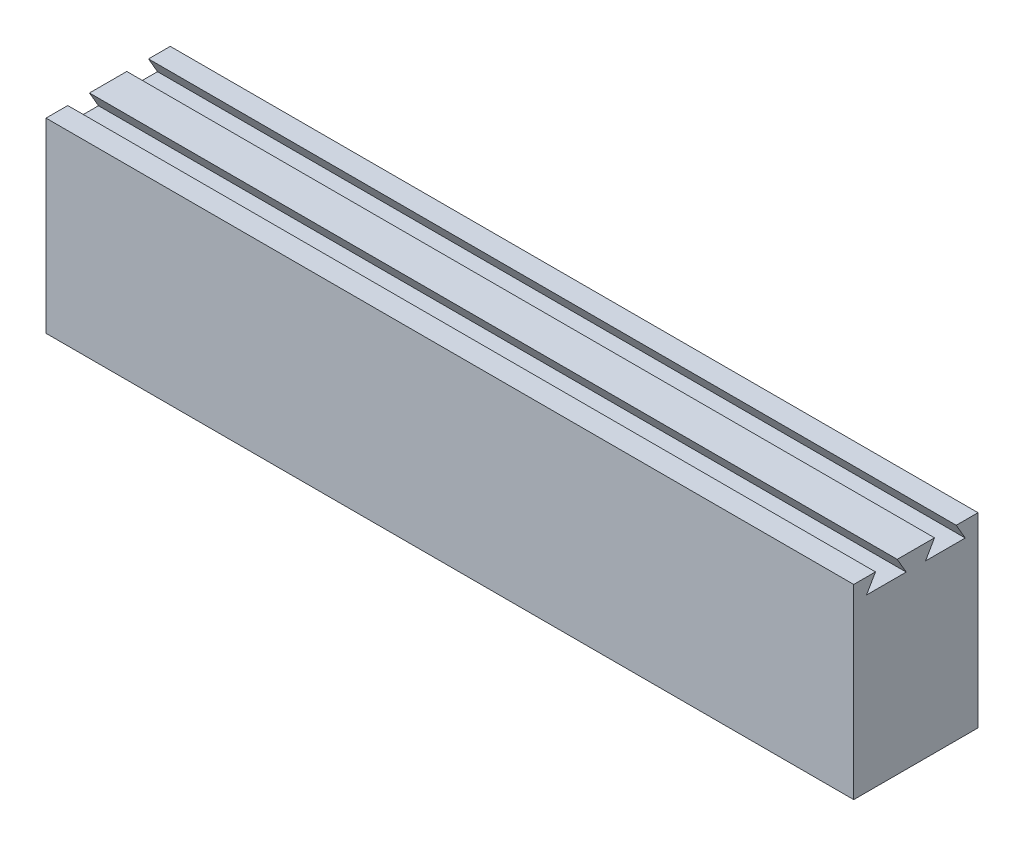
ISO-10303-21;
HEADER;
FILE_DESCRIPTION(('STEP AP214'),'2;1');
FILE_NAME('part.step','',(''),(''),'','','');
FILE_SCHEMA(('AUTOMOTIVE_DESIGN { 1 0 10303 214 1 1 1 1 }'));
ENDSEC;
DATA;
#1=APPLICATION_CONTEXT('core data for automotive mechanical design processes');
#2=APPLICATION_PROTOCOL_DEFINITION('international standard','automotive_design',2000,#1);
#3=PRODUCT_CONTEXT('',#1,'mechanical');
#4=PRODUCT('Part','Part','',(#3));
#5=PRODUCT_RELATED_PRODUCT_CATEGORY('part','',(#4));
#6=PRODUCT_DEFINITION_FORMATION('','',#4);
#7=PRODUCT_DEFINITION_CONTEXT('part definition',#1,'design');
#8=PRODUCT_DEFINITION('design','',#6,#7);
#9=PRODUCT_DEFINITION_SHAPE('','',#8);
#10=(LENGTH_UNIT() NAMED_UNIT(*) SI_UNIT(.MILLI.,.METRE.));
#11=(NAMED_UNIT(*) PLANE_ANGLE_UNIT() SI_UNIT($,.RADIAN.));
#12=(NAMED_UNIT(*) SI_UNIT($,.STERADIAN.) SOLID_ANGLE_UNIT());
#13=UNCERTAINTY_MEASURE_WITH_UNIT(LENGTH_MEASURE(1.E-05),#10,'distance_accuracy_value','');
#14=(GEOMETRIC_REPRESENTATION_CONTEXT(3) GLOBAL_UNCERTAINTY_ASSIGNED_CONTEXT((#13)) GLOBAL_UNIT_ASSIGNED_CONTEXT((#10,
#11,#12)) REPRESENTATION_CONTEXT('',''));
#15=CARTESIAN_POINT('',(0.,0.,0.));
#16=DIRECTION('',(0.,0.,1.));
#17=DIRECTION('',(1.,0.,0.));
#18=AXIS2_PLACEMENT_3D('',#15,#16,#17);
#19=CARTESIAN_POINT('',(65.,2.45096189432339,4.24519052838333));
#20=DIRECTION('',(0.,-0.500000000000004,-0.866025403784436));
#21=DIRECTION('',(0.,0.866025403784437,-0.500000000000004));
#22=AXIS2_PLACEMENT_3D('',#19,#20,#21);
#23=PLANE('',#22);
#24=DIRECTION('',(0.,-0.866025403784437,0.500000000000004));
#25=VECTOR('',#24,1.);
#26=CARTESIAN_POINT('',(-65.,2.45096189432339,4.24519052838333));
#27=LINE('',#26,#25);
#28=CARTESIAN_POINT('',(-65.,15.,-3.));
#29=VERTEX_POINT('',#28);
#30=CARTESIAN_POINT('',(-65.,12.497186583063,-1.555));
#31=VERTEX_POINT('',#30);
#32=EDGE_CURVE('E165',#29,#31,#27,.T.);
#33=ORIENTED_EDGE('',*,*,#32,.F.);
#34=DIRECTION('',(-1.,0.,0.));
#35=VECTOR('',#34,1.);
#36=CARTESIAN_POINT('',(65.,15.,-3.));
#37=LINE('',#36,#35);
#38=CARTESIAN_POINT('',(65.,15.,-3.));
#39=VERTEX_POINT('',#38);
#40=EDGE_CURVE('E11',#39,#29,#37,.T.);
#41=ORIENTED_EDGE('',*,*,#40,.F.);
#42=DIRECTION('',(0.,-0.866025403784437,0.500000000000004));
#43=VECTOR('',#42,1.);
#44=CARTESIAN_POINT('',(65.,2.45096189432339,4.24519052838333));
#45=LINE('',#44,#43);
#46=CARTESIAN_POINT('',(65.,12.497186583063,-1.555));
#47=VERTEX_POINT('',#46);
#48=EDGE_CURVE('E201',#39,#47,#45,.T.);
#49=ORIENTED_EDGE('',*,*,#48,.T.);
#50=DIRECTION('',(-1.,0.,0.));
#51=VECTOR('',#50,1.);
#52=CARTESIAN_POINT('',(65.,12.497186583063,-1.555));
#53=LINE('',#52,#51);
#54=EDGE_CURVE('E58',#47,#31,#53,.T.);
#55=ORIENTED_EDGE('',*,*,#54,.T.);
#56=EDGE_LOOP('',(#33,#41,#49,#55));
#57=FACE_BOUND('',#56,.T.);
#58=ADVANCED_FACE('F41',(#57),#23,.T.);
#59=CARTESIAN_POINT('',(65.,15.,0.));
#60=DIRECTION('',(0.,1.,0.));
#61=DIRECTION('',(0.,0.,1.));
#62=AXIS2_PLACEMENT_3D('',#59,#60,#61);
#63=PLANE('',#62);
#64=DIRECTION('',(0.,0.,-1.));
#65=VECTOR('',#64,1.);
#66=CARTESIAN_POINT('',(-65.,15.,0.));
#67=LINE('',#66,#65);
#68=CARTESIAN_POINT('',(-65.,15.,3.));
#69=VERTEX_POINT('',#68);
#70=EDGE_CURVE('E168',#69,#29,#67,.T.);
#71=ORIENTED_EDGE('',*,*,#70,.F.);
#72=DIRECTION('',(-1.,0.,0.));
#73=VECTOR('',#72,1.);
#74=CARTESIAN_POINT('',(65.,15.,3.));
#75=LINE('',#74,#73);
#76=CARTESIAN_POINT('',(65.,15.,3.));
#77=VERTEX_POINT('',#76);
#78=EDGE_CURVE('E50',#77,#69,#75,.T.);
#79=ORIENTED_EDGE('',*,*,#78,.F.);
#80=DIRECTION('',(0.,0.,-1.));
#81=VECTOR('',#80,1.);
#82=CARTESIAN_POINT('',(65.,15.,0.));
#83=LINE('',#82,#81);
#84=EDGE_CURVE('E155',#77,#39,#83,.T.);
#85=ORIENTED_EDGE('',*,*,#84,.T.);
#86=ORIENTED_EDGE('',*,*,#40,.T.);
#87=EDGE_LOOP('',(#71,#79,#85,#86));
#88=FACE_BOUND('',#87,.T.);
#89=ADVANCED_FACE('F243',(#88),#63,.T.);
#90=CARTESIAN_POINT('',(65.,2.45096189432339,-4.24519052838333));
#91=DIRECTION('',(0.,0.500000000000004,-0.866025403784436));
#92=DIRECTION('',(0.,0.866025403784437,0.500000000000004));
#93=AXIS2_PLACEMENT_3D('',#90,#91,#92);
#94=PLANE('',#93);
#95=DIRECTION('',(0.,-0.866025403784437,-0.500000000000004));
#96=VECTOR('',#95,1.);
#97=CARTESIAN_POINT('',(-65.,2.45096189432339,-4.24519052838333));
#98=LINE('',#97,#96);
#99=CARTESIAN_POINT('',(-65.,12.497186583063,1.555));
#100=VERTEX_POINT('',#99);
#101=EDGE_CURVE('E172',#69,#100,#98,.T.);
#102=ORIENTED_EDGE('',*,*,#101,.T.);
#103=DIRECTION('',(-1.,0.,0.));
#104=VECTOR('',#103,1.);
#105=CARTESIAN_POINT('',(65.,12.497186583063,1.555));
#106=LINE('',#105,#104);
#107=CARTESIAN_POINT('',(65.,12.497186583063,1.555));
#108=VERTEX_POINT('',#107);
#109=EDGE_CURVE('E225',#108,#100,#106,.T.);
#110=ORIENTED_EDGE('',*,*,#109,.F.);
#111=DIRECTION('',(0.,-0.866025403784437,-0.500000000000004));
#112=VECTOR('',#111,1.);
#113=CARTESIAN_POINT('',(65.,2.45096189432339,-4.24519052838333));
#114=LINE('',#113,#112);
#115=EDGE_CURVE('E234',#77,#108,#114,.T.);
#116=ORIENTED_EDGE('',*,*,#115,.F.);
#117=ORIENTED_EDGE('',*,*,#78,.T.);
#118=EDGE_LOOP('',(#102,#110,#116,#117));
#119=FACE_BOUND('',#118,.T.);
#120=ADVANCED_FACE('F232',(#119),#94,.F.);
#121=CARTESIAN_POINT('',(65.,12.497186583063,0.));
#122=DIRECTION('',(0.,-1.,0.));
#123=DIRECTION('',(0.,0.,-1.));
#124=AXIS2_PLACEMENT_3D('',#121,#122,#123);
#125=PLANE('',#124);
#126=DIRECTION('',(0.,0.,1.));
#127=VECTOR('',#126,1.);
#128=CARTESIAN_POINT('',(-65.,12.497186583063,0.));
#129=LINE('',#128,#127);
#130=CARTESIAN_POINT('',(-65.,12.497186583063,7.945));
#131=VERTEX_POINT('',#130);
#132=EDGE_CURVE('E176',#100,#131,#129,.T.);
#133=ORIENTED_EDGE('',*,*,#132,.T.);
#134=DIRECTION('',(-1.,0.,0.));
#135=VECTOR('',#134,1.);
#136=CARTESIAN_POINT('',(65.,12.497186583063,7.945));
#137=LINE('',#136,#135);
#138=CARTESIAN_POINT('',(65.,12.497186583063,7.945));
#139=VERTEX_POINT('',#138);
#140=EDGE_CURVE('E221',#139,#131,#137,.T.);
#141=ORIENTED_EDGE('',*,*,#140,.F.);
#142=DIRECTION('',(0.,0.,1.));
#143=VECTOR('',#142,1.);
#144=CARTESIAN_POINT('',(65.,12.497186583063,0.));
#145=LINE('',#144,#143);
#146=EDGE_CURVE('E316',#108,#139,#145,.T.);
#147=ORIENTED_EDGE('',*,*,#146,.F.);
#148=ORIENTED_EDGE('',*,*,#109,.T.);
#149=EDGE_LOOP('',(#133,#141,#147,#148));
#150=FACE_BOUND('',#149,.T.);
#151=ADVANCED_FACE('F263',(#150),#125,.F.);
#152=CARTESIAN_POINT('',(65.,6.56458256229951,11.3701905283833));
#153=DIRECTION('',(0.,0.500000000000005,0.866025403784436));
#154=DIRECTION('',(0.,-0.866025403784436,0.500000000000005));
#155=AXIS2_PLACEMENT_3D('',#152,#153,#154);
#156=PLANE('',#155);
#157=DIRECTION('',(0.,0.866025403784436,-0.500000000000005));
#158=VECTOR('',#157,1.);
#159=CARTESIAN_POINT('',(-65.,6.56458256229951,11.3701905283833));
#160=LINE('',#159,#158);
#161=CARTESIAN_POINT('',(-65.,15.,6.49999999999999));
#162=VERTEX_POINT('',#161);
#163=EDGE_CURVE('E179',#131,#162,#160,.T.);
#164=ORIENTED_EDGE('',*,*,#163,.T.);
#165=DIRECTION('',(-1.,0.,0.));
#166=VECTOR('',#165,1.);
#167=CARTESIAN_POINT('',(65.,15.,6.49999999999999));
#168=LINE('',#167,#166);
#169=CARTESIAN_POINT('',(65.,15.,6.49999999999999));
#170=VERTEX_POINT('',#169);
#171=EDGE_CURVE('E218',#170,#162,#168,.T.);
#172=ORIENTED_EDGE('',*,*,#171,.F.);
#173=DIRECTION('',(0.,0.866025403784436,-0.500000000000005));
#174=VECTOR('',#173,1.);
#175=CARTESIAN_POINT('',(65.,6.56458256229951,11.3701905283833));
#176=LINE('',#175,#174);
#177=EDGE_CURVE('E297',#139,#170,#176,.T.);
#178=ORIENTED_EDGE('',*,*,#177,.F.);
#179=ORIENTED_EDGE('',*,*,#140,.T.);
#180=EDGE_LOOP('',(#164,#172,#178,#179));
#181=FACE_BOUND('',#180,.T.);
#182=ADVANCED_FACE('F267',(#181),#156,.F.);
#183=CARTESIAN_POINT('',(-65.,15.,10.));
#184=VERTEX_POINT('',#183);
#185=EDGE_CURVE('E173',#184,#162,#67,.T.);
#186=ORIENTED_EDGE('',*,*,#185,.F.);
#187=DIRECTION('',(-1.,0.,0.));
#188=VECTOR('',#187,1.);
#189=CARTESIAN_POINT('',(65.,15.,10.));
#190=LINE('',#189,#188);
#191=CARTESIAN_POINT('',(65.,15.,10.));
#192=VERTEX_POINT('',#191);
#193=EDGE_CURVE('E215',#192,#184,#190,.T.);
#194=ORIENTED_EDGE('',*,*,#193,.F.);
#195=EDGE_CURVE('E154',#192,#170,#83,.T.);
#196=ORIENTED_EDGE('',*,*,#195,.T.);
#197=ORIENTED_EDGE('',*,*,#171,.T.);
#198=EDGE_LOOP('',(#186,#194,#196,#197));
#199=FACE_BOUND('',#198,.T.);
#200=ADVANCED_FACE('F259',(#199),#63,.T.);
#201=CARTESIAN_POINT('',(65.,0.,10.));
#202=DIRECTION('',(0.,0.,1.));
#203=DIRECTION('',(0.,-1.,0.));
#204=AXIS2_PLACEMENT_3D('',#201,#202,#203);
#205=PLANE('',#204);
#206=DIRECTION('',(0.,1.,0.));
#207=VECTOR('',#206,1.);
#208=CARTESIAN_POINT('',(-65.,0.,10.));
#209=LINE('',#208,#207);
#210=CARTESIAN_POINT('',(-65.,-15.,10.));
#211=VERTEX_POINT('',#210);
#212=EDGE_CURVE('E183',#211,#184,#209,.T.);
#213=ORIENTED_EDGE('',*,*,#212,.F.);
#214=DIRECTION('',(-1.,0.,0.));
#215=VECTOR('',#214,1.);
#216=CARTESIAN_POINT('',(65.,-15.,10.));
#217=LINE('',#216,#215);
#218=CARTESIAN_POINT('',(65.,-15.,10.));
#219=VERTEX_POINT('',#218);
#220=EDGE_CURVE('E212',#219,#211,#217,.T.);
#221=ORIENTED_EDGE('',*,*,#220,.F.);
#222=DIRECTION('',(0.,1.,0.));
#223=VECTOR('',#222,1.);
#224=CARTESIAN_POINT('',(65.,0.,10.));
#225=LINE('',#224,#223);
#226=EDGE_CURVE('E309',#219,#192,#225,.T.);
#227=ORIENTED_EDGE('',*,*,#226,.T.);
#228=ORIENTED_EDGE('',*,*,#193,.T.);
#229=EDGE_LOOP('',(#213,#221,#227,#228));
#230=FACE_BOUND('',#229,.T.);
#231=ADVANCED_FACE('F266',(#230),#205,.T.);
#232=CARTESIAN_POINT('',(65.,-15.,0.));
#233=DIRECTION('',(0.,1.,0.));
#234=DIRECTION('',(0.,0.,1.));
#235=AXIS2_PLACEMENT_3D('',#232,#233,#234);
#236=PLANE('',#235);
#237=DIRECTION('',(0.,0.,-1.));
#238=VECTOR('',#237,1.);
#239=CARTESIAN_POINT('',(-65.,-15.,0.));
#240=LINE('',#239,#238);
#241=CARTESIAN_POINT('',(-65.,-15.,-10.));
#242=VERTEX_POINT('',#241);
#243=EDGE_CURVE('E187',#211,#242,#240,.T.);
#244=ORIENTED_EDGE('',*,*,#243,.T.);
#245=DIRECTION('',(-1.,0.,0.));
#246=VECTOR('',#245,1.);
#247=CARTESIAN_POINT('',(65.,-15.,-10.));
#248=LINE('',#247,#246);
#249=CARTESIAN_POINT('',(65.,-15.,-10.));
#250=VERTEX_POINT('',#249);
#251=EDGE_CURVE('E208',#250,#242,#248,.T.);
#252=ORIENTED_EDGE('',*,*,#251,.F.);
#253=DIRECTION('',(0.,0.,-1.));
#254=VECTOR('',#253,1.);
#255=CARTESIAN_POINT('',(65.,-15.,0.));
#256=LINE('',#255,#254);
#257=EDGE_CURVE('E306',#219,#250,#256,.T.);
#258=ORIENTED_EDGE('',*,*,#257,.F.);
#259=ORIENTED_EDGE('',*,*,#220,.T.);
#260=EDGE_LOOP('',(#244,#252,#258,#259));
#261=FACE_BOUND('',#260,.T.);
#262=ADVANCED_FACE('F274',(#261),#236,.F.);
#263=CARTESIAN_POINT('',(65.,0.,-10.));
#264=DIRECTION('',(0.,0.,1.));
#265=DIRECTION('',(0.,-1.,0.));
#266=AXIS2_PLACEMENT_3D('',#263,#264,#265);
#267=PLANE('',#266);
#268=DIRECTION('',(0.,1.,0.));
#269=VECTOR('',#268,1.);
#270=CARTESIAN_POINT('',(-65.,0.,-10.));
#271=LINE('',#270,#269);
#272=CARTESIAN_POINT('',(-65.,15.,-10.));
#273=VERTEX_POINT('',#272);
#274=EDGE_CURVE('E190',#242,#273,#271,.T.);
#275=ORIENTED_EDGE('',*,*,#274,.T.);
#276=DIRECTION('',(-1.,0.,0.));
#277=VECTOR('',#276,1.);
#278=CARTESIAN_POINT('',(65.,15.,-10.));
#279=LINE('',#278,#277);
#280=CARTESIAN_POINT('',(65.,15.,-10.));
#281=VERTEX_POINT('',#280);
#282=EDGE_CURVE('E142',#281,#273,#279,.T.);
#283=ORIENTED_EDGE('',*,*,#282,.F.);
#284=DIRECTION('',(0.,1.,0.));
#285=VECTOR('',#284,1.);
#286=CARTESIAN_POINT('',(65.,0.,-10.));
#287=LINE('',#286,#285);
#288=EDGE_CURVE('E150',#250,#281,#287,.T.);
#289=ORIENTED_EDGE('',*,*,#288,.F.);
#290=ORIENTED_EDGE('',*,*,#251,.T.);
#291=EDGE_LOOP('',(#275,#283,#289,#290));
#292=FACE_BOUND('',#291,.T.);
#293=ADVANCED_FACE('F270',(#292),#267,.F.);
#294=CARTESIAN_POINT('',(-65.,15.,-6.49999999999999));
#295=VERTEX_POINT('',#294);
#296=EDGE_CURVE('E137',#295,#273,#67,.T.);
#297=ORIENTED_EDGE('',*,*,#296,.F.);
#298=DIRECTION('',(-1.,0.,0.));
#299=VECTOR('',#298,1.);
#300=CARTESIAN_POINT('',(65.,15.,-6.49999999999999));
#301=LINE('',#300,#299);
#302=CARTESIAN_POINT('',(65.,15.,-6.49999999999999));
#303=VERTEX_POINT('',#302);
#304=EDGE_CURVE('E132',#303,#295,#301,.T.);
#305=ORIENTED_EDGE('',*,*,#304,.F.);
#306=EDGE_CURVE('E135',#303,#281,#83,.T.);
#307=ORIENTED_EDGE('',*,*,#306,.T.);
#308=ORIENTED_EDGE('',*,*,#282,.T.);
#309=EDGE_LOOP('',(#297,#305,#307,#308));
#310=FACE_BOUND('',#309,.T.);
#311=ADVANCED_FACE('F134',(#310),#63,.T.);
#312=CARTESIAN_POINT('',(65.,6.56458256229951,-11.3701905283833));
#313=DIRECTION('',(0.,-0.500000000000005,0.866025403784436));
#314=DIRECTION('',(0.,-0.866025403784436,-0.500000000000005));
#315=AXIS2_PLACEMENT_3D('',#312,#313,#314);
#316=PLANE('',#315);
#317=DIRECTION('',(0.,0.866025403784436,0.500000000000005));
#318=VECTOR('',#317,1.);
#319=CARTESIAN_POINT('',(-65.,6.56458256229951,-11.3701905283833));
#320=LINE('',#319,#318);
#321=CARTESIAN_POINT('',(-65.,12.497186583063,-7.945));
#322=VERTEX_POINT('',#321);
#323=EDGE_CURVE('E194',#322,#295,#320,.T.);
#324=ORIENTED_EDGE('',*,*,#323,.F.);
#325=DIRECTION('',(-1.,0.,0.));
#326=VECTOR('',#325,1.);
#327=CARTESIAN_POINT('',(65.,12.497186583063,-7.945));
#328=LINE('',#327,#326);
#329=CARTESIAN_POINT('',(65.,12.497186583063,-7.945));
#330=VERTEX_POINT('',#329);
#331=EDGE_CURVE('E95',#330,#322,#328,.T.);
#332=ORIENTED_EDGE('',*,*,#331,.F.);
#333=DIRECTION('',(0.,0.866025403784436,0.500000000000005));
#334=VECTOR('',#333,1.);
#335=CARTESIAN_POINT('',(65.,6.56458256229951,-11.3701905283833));
#336=LINE('',#335,#334);
#337=EDGE_CURVE('E148',#330,#303,#336,.T.);
#338=ORIENTED_EDGE('',*,*,#337,.T.);
#339=ORIENTED_EDGE('',*,*,#304,.T.);
#340=EDGE_LOOP('',(#324,#332,#338,#339));
#341=FACE_BOUND('',#340,.T.);
#342=ADVANCED_FACE('F156',(#341),#316,.T.);
#343=CARTESIAN_POINT('',(65.,12.497186583063,0.));
#344=DIRECTION('',(0.,1.,0.));
#345=DIRECTION('',(0.,0.,1.));
#346=AXIS2_PLACEMENT_3D('',#343,#344,#345);
#347=PLANE('',#346);
#348=DIRECTION('',(0.,0.,-1.));
#349=VECTOR('',#348,1.);
#350=CARTESIAN_POINT('',(-65.,12.497186583063,0.));
#351=LINE('',#350,#349);
#352=EDGE_CURVE('E197',#31,#322,#351,.T.);
#353=ORIENTED_EDGE('',*,*,#352,.F.);
#354=ORIENTED_EDGE('',*,*,#54,.F.);
#355=DIRECTION('',(0.,0.,-1.));
#356=VECTOR('',#355,1.);
#357=CARTESIAN_POINT('',(65.,12.497186583063,0.));
#358=LINE('',#357,#356);
#359=EDGE_CURVE('E158',#47,#330,#358,.T.);
#360=ORIENTED_EDGE('',*,*,#359,.T.);
#361=ORIENTED_EDGE('',*,*,#331,.T.);
#362=EDGE_LOOP('',(#353,#354,#360,#361));
#363=FACE_BOUND('',#362,.T.);
#364=ADVANCED_FACE('F244',(#363),#347,.T.);
#365=CARTESIAN_POINT('',(65.,0.,0.));
#366=DIRECTION('',(1.,0.,0.));
#367=DIRECTION('',(0.,0.,-1.));
#368=AXIS2_PLACEMENT_3D('',#365,#366,#367);
#369=PLANE('',#368);
#370=ORIENTED_EDGE('',*,*,#48,.F.);
#371=ORIENTED_EDGE('',*,*,#84,.F.);
#372=ORIENTED_EDGE('',*,*,#115,.T.);
#373=ORIENTED_EDGE('',*,*,#146,.T.);
#374=ORIENTED_EDGE('',*,*,#177,.T.);
#375=ORIENTED_EDGE('',*,*,#195,.F.);
#376=ORIENTED_EDGE('',*,*,#226,.F.);
#377=ORIENTED_EDGE('',*,*,#257,.T.);
#378=ORIENTED_EDGE('',*,*,#288,.T.);
#379=ORIENTED_EDGE('',*,*,#306,.F.);
#380=ORIENTED_EDGE('',*,*,#337,.F.);
#381=ORIENTED_EDGE('',*,*,#359,.F.);
#382=EDGE_LOOP('',(#370,#371,#372,#373,#374,#375,#376,#377,#378,#379,#380,#381));
#383=FACE_BOUND('',#382,.T.);
#384=ADVANCED_FACE('F146',(#383),#369,.T.);
#385=CARTESIAN_POINT('',(-65.,0.,0.));
#386=DIRECTION('',(1.,0.,0.));
#387=DIRECTION('',(0.,0.,-1.));
#388=AXIS2_PLACEMENT_3D('',#385,#386,#387);
#389=PLANE('',#388);
#390=ORIENTED_EDGE('',*,*,#32,.T.);
#391=ORIENTED_EDGE('',*,*,#352,.T.);
#392=ORIENTED_EDGE('',*,*,#323,.T.);
#393=ORIENTED_EDGE('',*,*,#296,.T.);
#394=ORIENTED_EDGE('',*,*,#274,.F.);
#395=ORIENTED_EDGE('',*,*,#243,.F.);
#396=ORIENTED_EDGE('',*,*,#212,.T.);
#397=ORIENTED_EDGE('',*,*,#185,.T.);
#398=ORIENTED_EDGE('',*,*,#163,.F.);
#399=ORIENTED_EDGE('',*,*,#132,.F.);
#400=ORIENTED_EDGE('',*,*,#101,.F.);
#401=ORIENTED_EDGE('',*,*,#70,.T.);
#402=EDGE_LOOP('',(#390,#391,#392,#393,#394,#395,#396,#397,#398,#399,#400,#401));
#403=FACE_BOUND('',#402,.T.);
#404=ADVANCED_FACE('F241',(#403),#389,.F.);
#405=CLOSED_SHELL('',(#58,#89,#120,#151,#182,#200,#231,#262,#293,#311,#342,#364,#384,#404));
#406=MANIFOLD_SOLID_BREP('B2',#405);
#407=ADVANCED_BREP_SHAPE_REPRESENTATION('',(#18,#406),#14);
#408=SHAPE_DEFINITION_REPRESENTATION(#9,#407);
ENDSEC;
END-ISO-10303-21;
